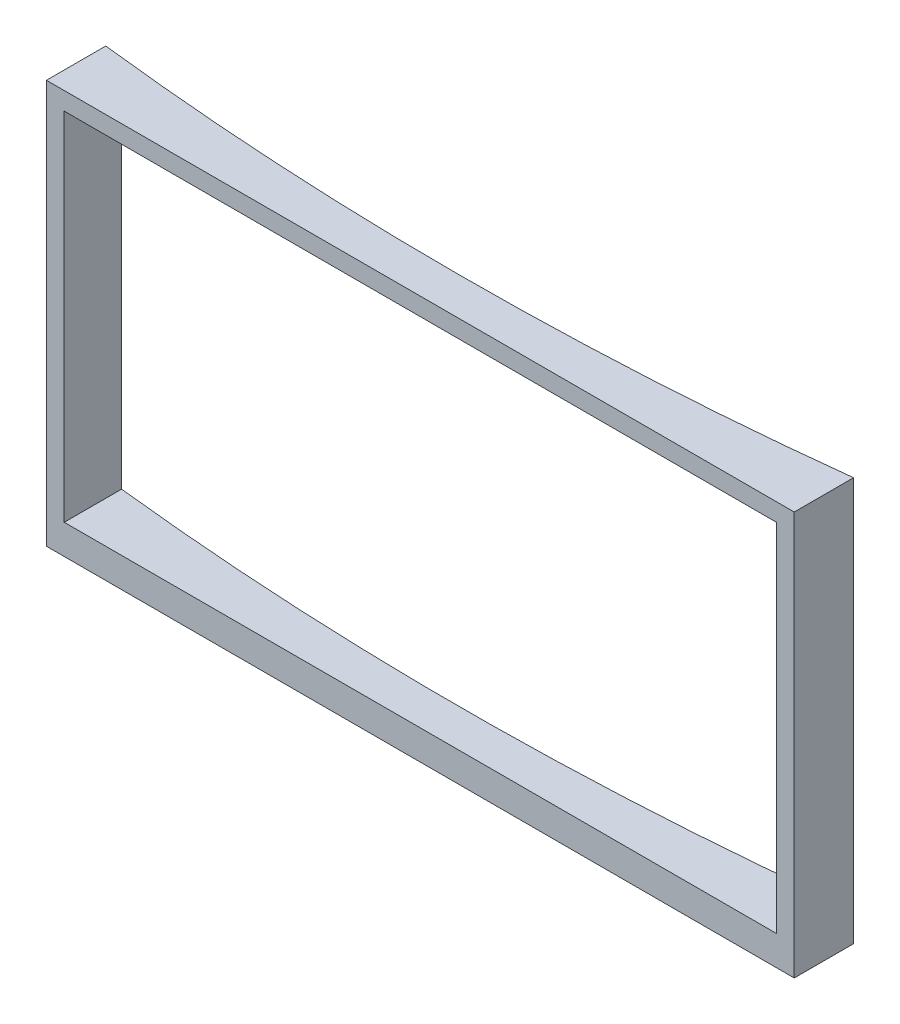
ISO-10303-21;
HEADER;
FILE_DESCRIPTION(('STEP AP214'),'2;1');
FILE_NAME('part.step','',(''),(''),'','','');
FILE_SCHEMA(('AUTOMOTIVE_DESIGN { 1 0 10303 214 1 1 1 1 }'));
ENDSEC;
DATA;
#1=APPLICATION_CONTEXT('core data for automotive mechanical design processes');
#2=APPLICATION_PROTOCOL_DEFINITION('international standard','automotive_design',2000,#1);
#3=PRODUCT_CONTEXT('',#1,'mechanical');
#4=PRODUCT('Part','Part','',(#3));
#5=PRODUCT_RELATED_PRODUCT_CATEGORY('part','',(#4));
#6=PRODUCT_DEFINITION_FORMATION('','',#4);
#7=PRODUCT_DEFINITION_CONTEXT('part definition',#1,'design');
#8=PRODUCT_DEFINITION('design','',#6,#7);
#9=PRODUCT_DEFINITION_SHAPE('','',#8);
#10=(LENGTH_UNIT() NAMED_UNIT(*) SI_UNIT(.MILLI.,.METRE.));
#11=(NAMED_UNIT(*) PLANE_ANGLE_UNIT() SI_UNIT($,.RADIAN.));
#12=(NAMED_UNIT(*) SI_UNIT($,.STERADIAN.) SOLID_ANGLE_UNIT());
#13=UNCERTAINTY_MEASURE_WITH_UNIT(LENGTH_MEASURE(1.E-05),#10,'distance_accuracy_value','');
#14=(GEOMETRIC_REPRESENTATION_CONTEXT(3) GLOBAL_UNCERTAINTY_ASSIGNED_CONTEXT((#13)) GLOBAL_UNIT_ASSIGNED_CONTEXT((#10,
#11,#12)) REPRESENTATION_CONTEXT('',''));
#15=CARTESIAN_POINT('',(0.,0.,0.));
#16=DIRECTION('',(0.,0.,1.));
#17=DIRECTION('',(1.,0.,0.));
#18=AXIS2_PLACEMENT_3D('',#15,#16,#17);
#19=CARTESIAN_POINT('',(8890.54648049518,3550.,3013.60985692235));
#20=DIRECTION('',(-1.,0.,0.));
#21=DIRECTION('',(0.,0.,1.));
#22=AXIS2_PLACEMENT_3D('',#19,#20,#21);
#23=PLANE('',#22);
#24=DIRECTION('',(0.,-1.,0.));
#25=VECTOR('',#24,1.);
#26=CARTESIAN_POINT('',(8890.54648049518,3550.,2513.60985692235));
#27=LINE('',#26,#25);
#28=CARTESIAN_POINT('',(8890.54648049518,3400.,2513.60985692235));
#29=VERTEX_POINT('',#28);
#30=CARTESIAN_POINT('',(8890.54648049518,0.,2513.60985692235));
#31=VERTEX_POINT('',#30);
#32=EDGE_CURVE('E11',#29,#31,#27,.T.);
#33=ORIENTED_EDGE('',*,*,#32,.F.);
#34=DIRECTION('',(0.,0.,1.));
#35=VECTOR('',#34,1.);
#36=CARTESIAN_POINT('',(8890.54648049518,3400.,1897.60985692235));
#37=LINE('',#36,#35);
#38=CARTESIAN_POINT('',(8890.54648049518,3400.,3013.60985692235));
#39=VERTEX_POINT('',#38);
#40=EDGE_CURVE('E108',#29,#39,#37,.T.);
#41=ORIENTED_EDGE('',*,*,#40,.T.);
#42=DIRECTION('',(0.,-1.,0.));
#43=VECTOR('',#42,1.);
#44=CARTESIAN_POINT('',(8890.54648049518,3550.,3013.60985692235));
#45=LINE('',#44,#43);
#46=CARTESIAN_POINT('',(8890.54648049518,0.,3013.60985692235));
#47=VERTEX_POINT('',#46);
#48=EDGE_CURVE('E118',#39,#47,#45,.T.);
#49=ORIENTED_EDGE('',*,*,#48,.T.);
#50=DIRECTION('',(0.,0.,-1.));
#51=VECTOR('',#50,1.);
#52=CARTESIAN_POINT('',(8890.54648049518,0.,3013.60985692235));
#53=LINE('',#52,#51);
#54=EDGE_CURVE('E149',#47,#31,#53,.T.);
#55=ORIENTED_EDGE('',*,*,#54,.T.);
#56=EDGE_LOOP('',(#33,#41,#49,#55));
#57=FACE_BOUND('',#56,.T.);
#58=ADVANCED_FACE('F44',(#57),#23,.F.);
#59=CARTESIAN_POINT('',(5740.54648049518,3550.,-24805.385366182));
#60=DIRECTION('',(0.,-1.,0.));
#61=DIRECTION('',(0.,0.,-1.));
#62=AXIS2_PLACEMENT_3D('',#59,#60,#61);
#63=CYLINDRICAL_SURFACE('',#62,27500.);
#64=CARTESIAN_POINT('',(5740.54648049518,250.,-24805.385366182));
#65=DIRECTION('',(0.,-1.,0.));
#66=DIRECTION('',(1.,0.,0.));
#67=AXIS2_PLACEMENT_3D('',#64,#65,#66);
#68=CIRCLE('',#67,27500.);
#69=CARTESIAN_POINT('',(2740.54648049518,249.999999999999,2530.48849949126));
#70=VERTEX_POINT('',#69);
#71=CARTESIAN_POINT('',(8740.54648049518,250.,2530.48849949126));
#72=VERTEX_POINT('',#71);
#73=EDGE_CURVE('E160',#70,#72,#68,.F.);
#74=ORIENTED_EDGE('',*,*,#73,.T.);
#75=DIRECTION('',(0.,-1.,0.));
#76=VECTOR('',#75,1.);
#77=CARTESIAN_POINT('',(8740.54648049518,3550.,2530.48849949126));
#78=LINE('',#77,#76);
#79=CARTESIAN_POINT('',(8740.54648049518,3250.,2530.48849949126));
#80=VERTEX_POINT('',#79);
#81=EDGE_CURVE('E156',#72,#80,#78,.F.);
#82=ORIENTED_EDGE('',*,*,#81,.T.);
#83=CARTESIAN_POINT('',(5740.54648049518,3250.,-24805.385366182));
#84=DIRECTION('',(0.,1.,0.));
#85=DIRECTION('',(-1.,0.,0.));
#86=AXIS2_PLACEMENT_3D('',#83,#84,#85);
#87=CIRCLE('',#86,27500.);
#88=CARTESIAN_POINT('',(2740.54648049518,3250.,2530.48849949126));
#89=VERTEX_POINT('',#88);
#90=EDGE_CURVE('E168',#80,#89,#87,.F.);
#91=ORIENTED_EDGE('',*,*,#90,.T.);
#92=DIRECTION('',(0.,-1.,0.));
#93=VECTOR('',#92,1.);
#94=CARTESIAN_POINT('',(2740.54648049518,3550.,2530.48849949126));
#95=LINE('',#94,#93);
#96=EDGE_CURVE('E164',#89,#70,#95,.T.);
#97=ORIENTED_EDGE('',*,*,#96,.T.);
#98=EDGE_LOOP('',(#74,#82,#91,#97));
#99=FACE_BOUND('',#98,.T.);
#100=DIRECTION('',(0.,-1.,0.));
#101=VECTOR('',#100,1.);
#102=CARTESIAN_POINT('',(2590.54648049518,3550.,2513.60985692235));
#103=LINE('',#102,#101);
#104=CARTESIAN_POINT('',(2590.54648049518,3400.,2513.60985692235));
#105=VERTEX_POINT('',#104);
#106=CARTESIAN_POINT('',(2590.54648049518,0.,2513.60985692235));
#107=VERTEX_POINT('',#106);
#108=EDGE_CURVE('E52',#105,#107,#103,.T.);
#109=ORIENTED_EDGE('',*,*,#108,.F.);
#110=CARTESIAN_POINT('',(5740.54648049518,3400.,-24805.385366182));
#111=DIRECTION('',(0.,-1.,0.));
#112=DIRECTION('',(1.,0.,0.));
#113=AXIS2_PLACEMENT_3D('',#110,#111,#112);
#114=CIRCLE('',#113,27500.);
#115=EDGE_CURVE('E121',#105,#29,#114,.F.);
#116=ORIENTED_EDGE('',*,*,#115,.T.);
#117=ORIENTED_EDGE('',*,*,#32,.T.);
#118=CARTESIAN_POINT('',(5740.54648049518,0.,-24805.385366182));
#119=DIRECTION('',(0.,-1.,0.));
#120=DIRECTION('',(0.,0.,1.));
#121=AXIS2_PLACEMENT_3D('',#118,#119,#120);
#122=CIRCLE('',#121,27500.);
#123=EDGE_CURVE('E145',#31,#107,#122,.T.);
#124=ORIENTED_EDGE('',*,*,#123,.T.);
#125=EDGE_LOOP('',(#109,#116,#117,#124));
#126=FACE_BOUND('',#125,.T.);
#127=ADVANCED_FACE('F146',(#99,#126),#63,.F.);
#128=CARTESIAN_POINT('',(2590.54648049518,3550.,3013.60985692235));
#129=DIRECTION('',(1.,0.,0.));
#130=DIRECTION('',(0.,0.,-1.));
#131=AXIS2_PLACEMENT_3D('',#128,#129,#130);
#132=PLANE('',#131);
#133=DIRECTION('',(0.,-1.,0.));
#134=VECTOR('',#133,1.);
#135=CARTESIAN_POINT('',(2590.54648049518,3550.,3013.60985692235));
#136=LINE('',#135,#134);
#137=CARTESIAN_POINT('',(2590.54648049518,3400.,3013.60985692235));
#138=VERTEX_POINT('',#137);
#139=CARTESIAN_POINT('',(2590.54648049518,0.,3013.60985692235));
#140=VERTEX_POINT('',#139);
#141=EDGE_CURVE('E128',#138,#140,#136,.T.);
#142=ORIENTED_EDGE('',*,*,#141,.F.);
#143=DIRECTION('',(0.,0.,1.));
#144=VECTOR('',#143,1.);
#145=CARTESIAN_POINT('',(2590.54648049518,3400.,1897.60985692235));
#146=LINE('',#145,#144);
#147=EDGE_CURVE('E59',#105,#138,#146,.T.);
#148=ORIENTED_EDGE('',*,*,#147,.F.);
#149=ORIENTED_EDGE('',*,*,#108,.T.);
#150=DIRECTION('',(0.,0.,1.));
#151=VECTOR('',#150,1.);
#152=CARTESIAN_POINT('',(2590.54648049518,0.,3013.60985692235));
#153=LINE('',#152,#151);
#154=EDGE_CURVE('E133',#107,#140,#153,.T.);
#155=ORIENTED_EDGE('',*,*,#154,.T.);
#156=EDGE_LOOP('',(#142,#148,#149,#155));
#157=FACE_BOUND('',#156,.T.);
#158=ADVANCED_FACE('F141',(#157),#132,.F.);
#159=CARTESIAN_POINT('',(2590.54648049518,3550.,3013.60985692235));
#160=DIRECTION('',(0.,0.,-1.));
#161=DIRECTION('',(-1.,0.,0.));
#162=AXIS2_PLACEMENT_3D('',#159,#160,#161);
#163=PLANE('',#162);
#164=DIRECTION('',(-1.,0.,0.));
#165=VECTOR('',#164,1.);
#166=CARTESIAN_POINT('',(2740.54648049518,3250.,3013.60985692235));
#167=LINE('',#166,#165);
#168=CARTESIAN_POINT('',(8740.54648049518,3250.,3013.60985692235));
#169=VERTEX_POINT('',#168);
#170=CARTESIAN_POINT('',(2740.54648049518,3250.,3013.60985692235));
#171=VERTEX_POINT('',#170);
#172=EDGE_CURVE('E192',#169,#171,#167,.T.);
#173=ORIENTED_EDGE('',*,*,#172,.F.);
#174=DIRECTION('',(0.,1.,0.));
#175=VECTOR('',#174,1.);
#176=CARTESIAN_POINT('',(8740.54648049518,3250.,3013.60985692235));
#177=LINE('',#176,#175);
#178=CARTESIAN_POINT('',(8740.54648049518,250.,3013.60985692235));
#179=VERTEX_POINT('',#178);
#180=EDGE_CURVE('E195',#179,#169,#177,.T.);
#181=ORIENTED_EDGE('',*,*,#180,.F.);
#182=DIRECTION('',(1.,0.,0.));
#183=VECTOR('',#182,1.);
#184=CARTESIAN_POINT('',(8740.54648049518,250.,3013.60985692235));
#185=LINE('',#184,#183);
#186=CARTESIAN_POINT('',(2740.54648049518,249.999999999999,3013.60985692235));
#187=VERTEX_POINT('',#186);
#188=EDGE_CURVE('E177',#187,#179,#185,.T.);
#189=ORIENTED_EDGE('',*,*,#188,.F.);
#190=DIRECTION('',(0.,-1.,0.));
#191=VECTOR('',#190,1.);
#192=CARTESIAN_POINT('',(2740.54648049518,249.999999999999,3013.60985692235));
#193=LINE('',#192,#191);
#194=EDGE_CURVE('E188',#171,#187,#193,.T.);
#195=ORIENTED_EDGE('',*,*,#194,.F.);
#196=EDGE_LOOP('',(#173,#181,#189,#195));
#197=FACE_BOUND('',#196,.T.);
#198=ORIENTED_EDGE('',*,*,#48,.F.);
#199=DIRECTION('',(1.,0.,0.));
#200=VECTOR('',#199,1.);
#201=CARTESIAN_POINT('',(2590.54648049518,3400.,3013.60985692235));
#202=LINE('',#201,#200);
#203=EDGE_CURVE('E105',#138,#39,#202,.T.);
#204=ORIENTED_EDGE('',*,*,#203,.F.);
#205=ORIENTED_EDGE('',*,*,#141,.T.);
#206=DIRECTION('',(1.,0.,0.));
#207=VECTOR('',#206,1.);
#208=CARTESIAN_POINT('',(2590.54648049518,0.,3013.60985692235));
#209=LINE('',#208,#207);
#210=EDGE_CURVE('E125',#140,#47,#209,.T.);
#211=ORIENTED_EDGE('',*,*,#210,.T.);
#212=EDGE_LOOP('',(#198,#204,#205,#211));
#213=FACE_BOUND('',#212,.T.);
#214=ADVANCED_FACE('F123',(#197,#213),#163,.F.);
#215=CARTESIAN_POINT('',(5740.54648049518,0.,-24805.385366182));
#216=DIRECTION('',(0.,1.,0.));
#217=DIRECTION('',(0.,0.,1.));
#218=AXIS2_PLACEMENT_3D('',#215,#216,#217);
#219=PLANE('',#218);
#220=ORIENTED_EDGE('',*,*,#54,.F.);
#221=ORIENTED_EDGE('',*,*,#210,.F.);
#222=ORIENTED_EDGE('',*,*,#154,.F.);
#223=ORIENTED_EDGE('',*,*,#123,.F.);
#224=EDGE_LOOP('',(#220,#221,#222,#223));
#225=FACE_BOUND('',#224,.T.);
#226=ADVANCED_FACE('F151',(#225),#219,.F.);
#227=CARTESIAN_POINT('',(8740.54648049518,3250.,-2986.39014307765));
#228=DIRECTION('',(1.,0.,0.));
#229=DIRECTION('',(0.,0.,-1.));
#230=AXIS2_PLACEMENT_3D('',#227,#228,#229);
#231=PLANE('',#230);
#232=DIRECTION('',(0.,0.,1.));
#233=VECTOR('',#232,1.);
#234=CARTESIAN_POINT('',(8740.54648049518,250.,-2986.39014307765));
#235=LINE('',#234,#233);
#236=EDGE_CURVE('E172',#72,#179,#235,.T.);
#237=ORIENTED_EDGE('',*,*,#236,.T.);
#238=ORIENTED_EDGE('',*,*,#180,.T.);
#239=DIRECTION('',(0.,0.,1.));
#240=VECTOR('',#239,1.);
#241=CARTESIAN_POINT('',(8740.54648049518,3250.,-2986.39014307765));
#242=LINE('',#241,#240);
#243=EDGE_CURVE('E173',#80,#169,#242,.T.);
#244=ORIENTED_EDGE('',*,*,#243,.F.);
#245=ORIENTED_EDGE('',*,*,#81,.F.);
#246=EDGE_LOOP('',(#237,#238,#244,#245));
#247=FACE_BOUND('',#246,.T.);
#248=ADVANCED_FACE('F204',(#247),#231,.F.);
#249=CARTESIAN_POINT('',(8740.54648049518,250.,-2986.39014307765));
#250=DIRECTION('',(0.,-1.,0.));
#251=DIRECTION('',(1.,0.,0.));
#252=AXIS2_PLACEMENT_3D('',#249,#250,#251);
#253=PLANE('',#252);
#254=DIRECTION('',(0.,0.,1.));
#255=VECTOR('',#254,1.);
#256=CARTESIAN_POINT('',(2740.54648049518,249.999999999999,-2986.39014307765));
#257=LINE('',#256,#255);
#258=EDGE_CURVE('E180',#70,#187,#257,.T.);
#259=ORIENTED_EDGE('',*,*,#258,.T.);
#260=ORIENTED_EDGE('',*,*,#188,.T.);
#261=ORIENTED_EDGE('',*,*,#236,.F.);
#262=ORIENTED_EDGE('',*,*,#73,.F.);
#263=EDGE_LOOP('',(#259,#260,#261,#262));
#264=FACE_BOUND('',#263,.T.);
#265=ADVANCED_FACE('F216',(#264),#253,.F.);
#266=CARTESIAN_POINT('',(2740.54648049518,249.999999999999,-2986.39014307765));
#267=DIRECTION('',(-1.,0.,0.));
#268=DIRECTION('',(0.,0.,1.));
#269=AXIS2_PLACEMENT_3D('',#266,#267,#268);
#270=PLANE('',#269);
#271=DIRECTION('',(0.,0.,1.));
#272=VECTOR('',#271,1.);
#273=CARTESIAN_POINT('',(2740.54648049518,3250.,-2986.39014307765));
#274=LINE('',#273,#272);
#275=EDGE_CURVE('E67',#89,#171,#274,.T.);
#276=ORIENTED_EDGE('',*,*,#275,.T.);
#277=ORIENTED_EDGE('',*,*,#194,.T.);
#278=ORIENTED_EDGE('',*,*,#258,.F.);
#279=ORIENTED_EDGE('',*,*,#96,.F.);
#280=EDGE_LOOP('',(#276,#277,#278,#279));
#281=FACE_BOUND('',#280,.T.);
#282=ADVANCED_FACE('F213',(#281),#270,.F.);
#283=CARTESIAN_POINT('',(2740.54648049518,3250.,-2986.39014307765));
#284=DIRECTION('',(0.,1.,0.));
#285=DIRECTION('',(-1.,0.,0.));
#286=AXIS2_PLACEMENT_3D('',#283,#284,#285);
#287=PLANE('',#286);
#288=ORIENTED_EDGE('',*,*,#243,.T.);
#289=ORIENTED_EDGE('',*,*,#172,.T.);
#290=ORIENTED_EDGE('',*,*,#275,.F.);
#291=ORIENTED_EDGE('',*,*,#90,.F.);
#292=EDGE_LOOP('',(#288,#289,#290,#291));
#293=FACE_BOUND('',#292,.T.);
#294=ADVANCED_FACE('F209',(#293),#287,.F.);
#295=CARTESIAN_POINT('',(2590.54648049518,3400.,1897.60985692235));
#296=DIRECTION('',(0.,-1.,0.));
#297=DIRECTION('',(1.,0.,0.));
#298=AXIS2_PLACEMENT_3D('',#295,#296,#297);
#299=PLANE('',#298);
#300=ORIENTED_EDGE('',*,*,#147,.T.);
#301=ORIENTED_EDGE('',*,*,#203,.T.);
#302=ORIENTED_EDGE('',*,*,#40,.F.);
#303=ORIENTED_EDGE('',*,*,#115,.F.);
#304=EDGE_LOOP('',(#300,#301,#302,#303));
#305=FACE_BOUND('',#304,.T.);
#306=ADVANCED_FACE('F107',(#305),#299,.F.);
#307=CLOSED_SHELL('',(#58,#127,#158,#214,#226,#248,#265,#282,#294,#306));
#308=MANIFOLD_SOLID_BREP('B2',#307);
#309=ADVANCED_BREP_SHAPE_REPRESENTATION('',(#18,#308),#14);
#310=SHAPE_DEFINITION_REPRESENTATION(#9,#309);
ENDSEC;
END-ISO-10303-21;
